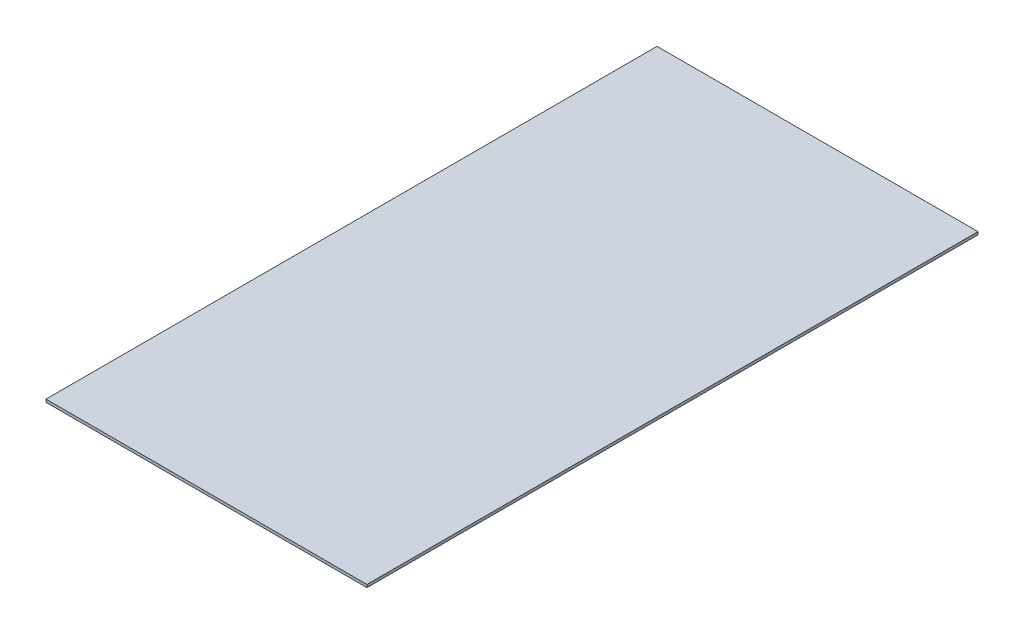
ISO-10303-21;
HEADER;
FILE_DESCRIPTION(('STEP AP214'),'2;1');
FILE_NAME('part.step','',(''),(''),'','','');
FILE_SCHEMA(('AUTOMOTIVE_DESIGN { 1 0 10303 214 1 1 1 1 }'));
ENDSEC;
DATA;
#1=APPLICATION_CONTEXT('core data for automotive mechanical design processes');
#2=APPLICATION_PROTOCOL_DEFINITION('international standard','automotive_design',2000,#1);
#3=PRODUCT_CONTEXT('',#1,'mechanical');
#4=PRODUCT('Part','Part','',(#3));
#5=PRODUCT_RELATED_PRODUCT_CATEGORY('part','',(#4));
#6=PRODUCT_DEFINITION_FORMATION('','',#4);
#7=PRODUCT_DEFINITION_CONTEXT('part definition',#1,'design');
#8=PRODUCT_DEFINITION('design','',#6,#7);
#9=PRODUCT_DEFINITION_SHAPE('','',#8);
#10=(LENGTH_UNIT() NAMED_UNIT(*) SI_UNIT(.MILLI.,.METRE.));
#11=(NAMED_UNIT(*) PLANE_ANGLE_UNIT() SI_UNIT($,.RADIAN.));
#12=(NAMED_UNIT(*) SI_UNIT($,.STERADIAN.) SOLID_ANGLE_UNIT());
#13=UNCERTAINTY_MEASURE_WITH_UNIT(LENGTH_MEASURE(1.E-05),#10,'distance_accuracy_value','');
#14=(GEOMETRIC_REPRESENTATION_CONTEXT(3) GLOBAL_UNCERTAINTY_ASSIGNED_CONTEXT((#13)) GLOBAL_UNIT_ASSIGNED_CONTEXT((#10,
#11,#12)) REPRESENTATION_CONTEXT('',''));
#15=CARTESIAN_POINT('',(0.,0.,0.));
#16=DIRECTION('',(0.,0.,1.));
#17=DIRECTION('',(1.,0.,0.));
#18=AXIS2_PLACEMENT_3D('',#15,#16,#17);
#19=CARTESIAN_POINT('',(114.5,2.,218.));
#20=DIRECTION('',(-1.,0.,0.));
#21=DIRECTION('',(0.,0.,1.));
#22=AXIS2_PLACEMENT_3D('',#19,#20,#21);
#23=PLANE('',#22);
#24=DIRECTION('',(0.,0.,-1.));
#25=VECTOR('',#24,1.);
#26=CARTESIAN_POINT('',(114.5,0.,218.));
#27=LINE('',#26,#25);
#28=CARTESIAN_POINT('',(114.5,0.,218.));
#29=VERTEX_POINT('',#28);
#30=CARTESIAN_POINT('',(114.5,0.,-218.));
#31=VERTEX_POINT('',#30);
#32=EDGE_CURVE('E99',#29,#31,#27,.T.);
#33=ORIENTED_EDGE('',*,*,#32,.T.);
#34=DIRECTION('',(0.,-1.,0.));
#35=VECTOR('',#34,1.);
#36=CARTESIAN_POINT('',(114.5,2.,-218.));
#37=LINE('',#36,#35);
#38=CARTESIAN_POINT('',(114.5,2.,-218.));
#39=VERTEX_POINT('',#38);
#40=EDGE_CURVE('E11',#39,#31,#37,.T.);
#41=ORIENTED_EDGE('',*,*,#40,.F.);
#42=DIRECTION('',(0.,0.,-1.));
#43=VECTOR('',#42,1.);
#44=CARTESIAN_POINT('',(114.5,2.,218.));
#45=LINE('',#44,#43);
#46=CARTESIAN_POINT('',(114.5,2.,218.));
#47=VERTEX_POINT('',#46);
#48=EDGE_CURVE('E87',#47,#39,#45,.T.);
#49=ORIENTED_EDGE('',*,*,#48,.F.);
#50=DIRECTION('',(0.,-1.,0.));
#51=VECTOR('',#50,1.);
#52=CARTESIAN_POINT('',(114.5,2.,218.));
#53=LINE('',#52,#51);
#54=EDGE_CURVE('E95',#47,#29,#53,.T.);
#55=ORIENTED_EDGE('',*,*,#54,.T.);
#56=EDGE_LOOP('',(#33,#41,#49,#55));
#57=FACE_BOUND('',#56,.T.);
#58=ADVANCED_FACE('F36',(#57),#23,.F.);
#59=CARTESIAN_POINT('',(-114.5,2.,-218.));
#60=DIRECTION('',(0.,0.,1.));
#61=DIRECTION('',(1.,0.,0.));
#62=AXIS2_PLACEMENT_3D('',#59,#60,#61);
#63=PLANE('',#62);
#64=DIRECTION('',(-1.,0.,0.));
#65=VECTOR('',#64,1.);
#66=CARTESIAN_POINT('',(-114.5,0.,-218.));
#67=LINE('',#66,#65);
#68=CARTESIAN_POINT('',(-114.5,0.,-218.));
#69=VERTEX_POINT('',#68);
#70=EDGE_CURVE('E91',#31,#69,#67,.T.);
#71=ORIENTED_EDGE('',*,*,#70,.T.);
#72=DIRECTION('',(0.,-1.,0.));
#73=VECTOR('',#72,1.);
#74=CARTESIAN_POINT('',(-114.5,2.,-218.));
#75=LINE('',#74,#73);
#76=CARTESIAN_POINT('',(-114.5,2.,-218.));
#77=VERTEX_POINT('',#76);
#78=EDGE_CURVE('E44',#77,#69,#75,.T.);
#79=ORIENTED_EDGE('',*,*,#78,.F.);
#80=DIRECTION('',(-1.,0.,0.));
#81=VECTOR('',#80,1.);
#82=CARTESIAN_POINT('',(-114.5,2.,-218.));
#83=LINE('',#82,#81);
#84=EDGE_CURVE('E82',#39,#77,#83,.T.);
#85=ORIENTED_EDGE('',*,*,#84,.F.);
#86=ORIENTED_EDGE('',*,*,#40,.T.);
#87=EDGE_LOOP('',(#71,#79,#85,#86));
#88=FACE_BOUND('',#87,.T.);
#89=ADVANCED_FACE('F90',(#88),#63,.F.);
#90=CARTESIAN_POINT('',(-114.5,2.,218.));
#91=DIRECTION('',(1.,0.,0.));
#92=DIRECTION('',(0.,0.,-1.));
#93=AXIS2_PLACEMENT_3D('',#90,#91,#92);
#94=PLANE('',#93);
#95=DIRECTION('',(0.,0.,1.));
#96=VECTOR('',#95,1.);
#97=CARTESIAN_POINT('',(-114.5,0.,218.));
#98=LINE('',#97,#96);
#99=CARTESIAN_POINT('',(-114.5,0.,218.));
#100=VERTEX_POINT('',#99);
#101=EDGE_CURVE('E69',#69,#100,#98,.T.);
#102=ORIENTED_EDGE('',*,*,#101,.T.);
#103=DIRECTION('',(0.,-1.,0.));
#104=VECTOR('',#103,1.);
#105=CARTESIAN_POINT('',(-114.5,2.,218.));
#106=LINE('',#105,#104);
#107=CARTESIAN_POINT('',(-114.5,2.,218.));
#108=VERTEX_POINT('',#107);
#109=EDGE_CURVE('E92',#108,#100,#106,.T.);
#110=ORIENTED_EDGE('',*,*,#109,.F.);
#111=DIRECTION('',(0.,0.,1.));
#112=VECTOR('',#111,1.);
#113=CARTESIAN_POINT('',(-114.5,2.,218.));
#114=LINE('',#113,#112);
#115=EDGE_CURVE('E85',#77,#108,#114,.T.);
#116=ORIENTED_EDGE('',*,*,#115,.F.);
#117=ORIENTED_EDGE('',*,*,#78,.T.);
#118=EDGE_LOOP('',(#102,#110,#116,#117));
#119=FACE_BOUND('',#118,.T.);
#120=ADVANCED_FACE('F93',(#119),#94,.F.);
#121=CARTESIAN_POINT('',(-114.5,2.,218.));
#122=DIRECTION('',(0.,0.,-1.));
#123=DIRECTION('',(-1.,0.,0.));
#124=AXIS2_PLACEMENT_3D('',#121,#122,#123);
#125=PLANE('',#124);
#126=DIRECTION('',(1.,0.,0.));
#127=VECTOR('',#126,1.);
#128=CARTESIAN_POINT('',(-114.5,0.,218.));
#129=LINE('',#128,#127);
#130=EDGE_CURVE('E75',#100,#29,#129,.T.);
#131=ORIENTED_EDGE('',*,*,#130,.T.);
#132=ORIENTED_EDGE('',*,*,#54,.F.);
#133=DIRECTION('',(1.,0.,0.));
#134=VECTOR('',#133,1.);
#135=CARTESIAN_POINT('',(-114.5,2.,218.));
#136=LINE('',#135,#134);
#137=EDGE_CURVE('E52',#108,#47,#136,.T.);
#138=ORIENTED_EDGE('',*,*,#137,.F.);
#139=ORIENTED_EDGE('',*,*,#109,.T.);
#140=EDGE_LOOP('',(#131,#132,#138,#139));
#141=FACE_BOUND('',#140,.T.);
#142=ADVANCED_FACE('F106',(#141),#125,.F.);
#143=CARTESIAN_POINT('',(0.,2.,0.));
#144=DIRECTION('',(0.,-1.,0.));
#145=DIRECTION('',(0.,0.,-1.));
#146=AXIS2_PLACEMENT_3D('',#143,#144,#145);
#147=PLANE('',#146);
#148=ORIENTED_EDGE('',*,*,#48,.T.);
#149=ORIENTED_EDGE('',*,*,#84,.T.);
#150=ORIENTED_EDGE('',*,*,#115,.T.);
#151=ORIENTED_EDGE('',*,*,#137,.T.);
#152=EDGE_LOOP('',(#148,#149,#150,#151));
#153=FACE_BOUND('',#152,.T.);
#154=ADVANCED_FACE('F83',(#153),#147,.F.);
#155=CARTESIAN_POINT('',(0.,0.,0.));
#156=DIRECTION('',(0.,-1.,0.));
#157=DIRECTION('',(0.,0.,-1.));
#158=AXIS2_PLACEMENT_3D('',#155,#156,#157);
#159=PLANE('',#158);
#160=ORIENTED_EDGE('',*,*,#32,.F.);
#161=ORIENTED_EDGE('',*,*,#130,.F.);
#162=ORIENTED_EDGE('',*,*,#101,.F.);
#163=ORIENTED_EDGE('',*,*,#70,.F.);
#164=EDGE_LOOP('',(#160,#161,#162,#163));
#165=FACE_BOUND('',#164,.T.);
#166=ADVANCED_FACE('F109',(#165),#159,.T.);
#167=CLOSED_SHELL('',(#58,#89,#120,#142,#154,#166));
#168=MANIFOLD_SOLID_BREP('B2',#167);
#169=ADVANCED_BREP_SHAPE_REPRESENTATION('',(#18,#168),#14);
#170=SHAPE_DEFINITION_REPRESENTATION(#9,#169);
ENDSEC;
END-ISO-10303-21;
